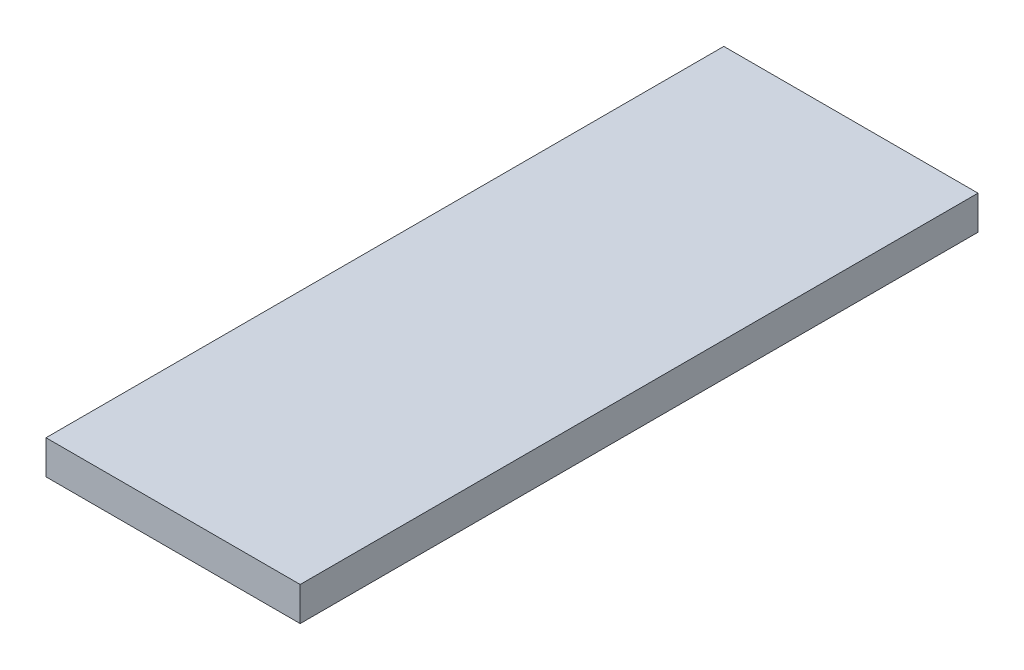
ISO-10303-21;
HEADER;
FILE_DESCRIPTION(('STEP AP214'),'2;1');
FILE_NAME('part.step','',(''),(''),'','','');
FILE_SCHEMA(('AUTOMOTIVE_DESIGN { 1 0 10303 214 1 1 1 1 }'));
ENDSEC;
DATA;
#1=APPLICATION_CONTEXT('core data for automotive mechanical design processes');
#2=APPLICATION_PROTOCOL_DEFINITION('international standard','automotive_design',2000,#1);
#3=PRODUCT_CONTEXT('',#1,'mechanical');
#4=PRODUCT('Part','Part','',(#3));
#5=PRODUCT_RELATED_PRODUCT_CATEGORY('part','',(#4));
#6=PRODUCT_DEFINITION_FORMATION('','',#4);
#7=PRODUCT_DEFINITION_CONTEXT('part definition',#1,'design');
#8=PRODUCT_DEFINITION('design','',#6,#7);
#9=PRODUCT_DEFINITION_SHAPE('','',#8);
#10=(LENGTH_UNIT() NAMED_UNIT(*) SI_UNIT(.MILLI.,.METRE.));
#11=(NAMED_UNIT(*) PLANE_ANGLE_UNIT() SI_UNIT($,.RADIAN.));
#12=(NAMED_UNIT(*) SI_UNIT($,.STERADIAN.) SOLID_ANGLE_UNIT());
#13=UNCERTAINTY_MEASURE_WITH_UNIT(LENGTH_MEASURE(1.E-05),#10,'distance_accuracy_value','');
#14=(GEOMETRIC_REPRESENTATION_CONTEXT(3) GLOBAL_UNCERTAINTY_ASSIGNED_CONTEXT((#13)) GLOBAL_UNIT_ASSIGNED_CONTEXT((#10,
#11,#12)) REPRESENTATION_CONTEXT('',''));
#15=CARTESIAN_POINT('',(0.,0.,0.));
#16=DIRECTION('',(0.,0.,1.));
#17=DIRECTION('',(1.,0.,0.));
#18=AXIS2_PLACEMENT_3D('',#15,#16,#17);
#19=CARTESIAN_POINT('',(75.,20.,-200.));
#20=DIRECTION('',(-1.,0.,0.));
#21=DIRECTION('',(0.,0.,1.));
#22=AXIS2_PLACEMENT_3D('',#19,#20,#21);
#23=PLANE('',#22);
#24=DIRECTION('',(0.,0.,-1.));
#25=VECTOR('',#24,1.);
#26=CARTESIAN_POINT('',(75.,0.,-200.));
#27=LINE('',#26,#25);
#28=CARTESIAN_POINT('',(75.,0.,200.));
#29=VERTEX_POINT('',#28);
#30=CARTESIAN_POINT('',(75.,0.,-200.));
#31=VERTEX_POINT('',#30);
#32=EDGE_CURVE('E95',#29,#31,#27,.T.);
#33=ORIENTED_EDGE('',*,*,#32,.T.);
#34=DIRECTION('',(0.,-1.,0.));
#35=VECTOR('',#34,1.);
#36=CARTESIAN_POINT('',(75.,20.,-200.));
#37=LINE('',#36,#35);
#38=CARTESIAN_POINT('',(75.,20.,-200.));
#39=VERTEX_POINT('',#38);
#40=EDGE_CURVE('E11',#39,#31,#37,.T.);
#41=ORIENTED_EDGE('',*,*,#40,.F.);
#42=DIRECTION('',(0.,0.,-1.));
#43=VECTOR('',#42,1.);
#44=CARTESIAN_POINT('',(75.,20.,-200.));
#45=LINE('',#44,#43);
#46=CARTESIAN_POINT('',(75.,20.,200.));
#47=VERTEX_POINT('',#46);
#48=EDGE_CURVE('E83',#47,#39,#45,.T.);
#49=ORIENTED_EDGE('',*,*,#48,.F.);
#50=DIRECTION('',(0.,-1.,0.));
#51=VECTOR('',#50,1.);
#52=CARTESIAN_POINT('',(75.,20.,200.));
#53=LINE('',#52,#51);
#54=EDGE_CURVE('E91',#47,#29,#53,.T.);
#55=ORIENTED_EDGE('',*,*,#54,.T.);
#56=EDGE_LOOP('',(#33,#41,#49,#55));
#57=FACE_BOUND('',#56,.T.);
#58=ADVANCED_FACE('F32',(#57),#23,.F.);
#59=CARTESIAN_POINT('',(-75.,20.,-200.));
#60=DIRECTION('',(0.,0.,1.));
#61=DIRECTION('',(1.,0.,0.));
#62=AXIS2_PLACEMENT_3D('',#59,#60,#61);
#63=PLANE('',#62);
#64=DIRECTION('',(-1.,0.,0.));
#65=VECTOR('',#64,1.);
#66=CARTESIAN_POINT('',(-75.,0.,-200.));
#67=LINE('',#66,#65);
#68=CARTESIAN_POINT('',(-75.,0.,-200.));
#69=VERTEX_POINT('',#68);
#70=EDGE_CURVE('E87',#31,#69,#67,.T.);
#71=ORIENTED_EDGE('',*,*,#70,.T.);
#72=DIRECTION('',(0.,-1.,0.));
#73=VECTOR('',#72,1.);
#74=CARTESIAN_POINT('',(-75.,20.,-200.));
#75=LINE('',#74,#73);
#76=CARTESIAN_POINT('',(-75.,20.,-200.));
#77=VERTEX_POINT('',#76);
#78=EDGE_CURVE('E40',#77,#69,#75,.T.);
#79=ORIENTED_EDGE('',*,*,#78,.F.);
#80=DIRECTION('',(-1.,0.,0.));
#81=VECTOR('',#80,1.);
#82=CARTESIAN_POINT('',(-75.,20.,-200.));
#83=LINE('',#82,#81);
#84=EDGE_CURVE('E78',#39,#77,#83,.T.);
#85=ORIENTED_EDGE('',*,*,#84,.F.);
#86=ORIENTED_EDGE('',*,*,#40,.T.);
#87=EDGE_LOOP('',(#71,#79,#85,#86));
#88=FACE_BOUND('',#87,.T.);
#89=ADVANCED_FACE('F86',(#88),#63,.F.);
#90=CARTESIAN_POINT('',(-75.,20.,-200.));
#91=DIRECTION('',(1.,0.,0.));
#92=DIRECTION('',(0.,0.,-1.));
#93=AXIS2_PLACEMENT_3D('',#90,#91,#92);
#94=PLANE('',#93);
#95=DIRECTION('',(0.,0.,1.));
#96=VECTOR('',#95,1.);
#97=CARTESIAN_POINT('',(-75.,0.,-200.));
#98=LINE('',#97,#96);
#99=CARTESIAN_POINT('',(-75.,0.,200.));
#100=VERTEX_POINT('',#99);
#101=EDGE_CURVE('E65',#69,#100,#98,.T.);
#102=ORIENTED_EDGE('',*,*,#101,.T.);
#103=DIRECTION('',(0.,-1.,0.));
#104=VECTOR('',#103,1.);
#105=CARTESIAN_POINT('',(-75.,20.,200.));
#106=LINE('',#105,#104);
#107=CARTESIAN_POINT('',(-75.,20.,200.));
#108=VERTEX_POINT('',#107);
#109=EDGE_CURVE('E88',#108,#100,#106,.T.);
#110=ORIENTED_EDGE('',*,*,#109,.F.);
#111=DIRECTION('',(0.,0.,1.));
#112=VECTOR('',#111,1.);
#113=CARTESIAN_POINT('',(-75.,20.,-200.));
#114=LINE('',#113,#112);
#115=EDGE_CURVE('E81',#77,#108,#114,.T.);
#116=ORIENTED_EDGE('',*,*,#115,.F.);
#117=ORIENTED_EDGE('',*,*,#78,.T.);
#118=EDGE_LOOP('',(#102,#110,#116,#117));
#119=FACE_BOUND('',#118,.T.);
#120=ADVANCED_FACE('F89',(#119),#94,.F.);
#121=CARTESIAN_POINT('',(-75.,20.,200.));
#122=DIRECTION('',(0.,0.,-1.));
#123=DIRECTION('',(-1.,0.,0.));
#124=AXIS2_PLACEMENT_3D('',#121,#122,#123);
#125=PLANE('',#124);
#126=DIRECTION('',(1.,0.,0.));
#127=VECTOR('',#126,1.);
#128=CARTESIAN_POINT('',(-75.,0.,200.));
#129=LINE('',#128,#127);
#130=EDGE_CURVE('E71',#100,#29,#129,.T.);
#131=ORIENTED_EDGE('',*,*,#130,.T.);
#132=ORIENTED_EDGE('',*,*,#54,.F.);
#133=DIRECTION('',(1.,0.,0.));
#134=VECTOR('',#133,1.);
#135=CARTESIAN_POINT('',(-75.,20.,200.));
#136=LINE('',#135,#134);
#137=EDGE_CURVE('E48',#108,#47,#136,.T.);
#138=ORIENTED_EDGE('',*,*,#137,.F.);
#139=ORIENTED_EDGE('',*,*,#109,.T.);
#140=EDGE_LOOP('',(#131,#132,#138,#139));
#141=FACE_BOUND('',#140,.T.);
#142=ADVANCED_FACE('F102',(#141),#125,.F.);
#143=CARTESIAN_POINT('',(0.,20.,0.));
#144=DIRECTION('',(0.,1.,0.));
#145=DIRECTION('',(0.,0.,1.));
#146=AXIS2_PLACEMENT_3D('',#143,#144,#145);
#147=PLANE('',#146);
#148=ORIENTED_EDGE('',*,*,#48,.T.);
#149=ORIENTED_EDGE('',*,*,#84,.T.);
#150=ORIENTED_EDGE('',*,*,#115,.T.);
#151=ORIENTED_EDGE('',*,*,#137,.T.);
#152=EDGE_LOOP('',(#148,#149,#150,#151));
#153=FACE_BOUND('',#152,.T.);
#154=ADVANCED_FACE('F79',(#153),#147,.T.);
#155=CARTESIAN_POINT('',(0.,0.,0.));
#156=DIRECTION('',(0.,1.,0.));
#157=DIRECTION('',(0.,0.,1.));
#158=AXIS2_PLACEMENT_3D('',#155,#156,#157);
#159=PLANE('',#158);
#160=ORIENTED_EDGE('',*,*,#32,.F.);
#161=ORIENTED_EDGE('',*,*,#130,.F.);
#162=ORIENTED_EDGE('',*,*,#101,.F.);
#163=ORIENTED_EDGE('',*,*,#70,.F.);
#164=EDGE_LOOP('',(#160,#161,#162,#163));
#165=FACE_BOUND('',#164,.T.);
#166=ADVANCED_FACE('F105',(#165),#159,.F.);
#167=CLOSED_SHELL('',(#58,#89,#120,#142,#154,#166));
#168=MANIFOLD_SOLID_BREP('B2',#167);
#169=ADVANCED_BREP_SHAPE_REPRESENTATION('',(#18,#168),#14);
#170=SHAPE_DEFINITION_REPRESENTATION(#9,#169);
ENDSEC;
END-ISO-10303-21;
